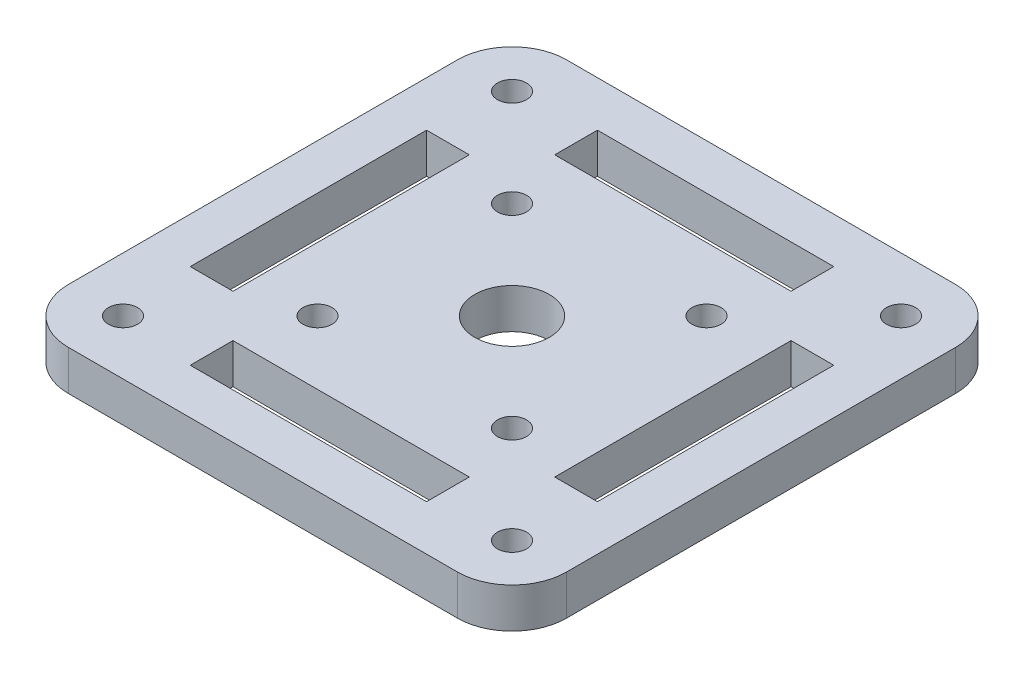
ISO-10303-21;
HEADER;
FILE_DESCRIPTION(('STEP AP214'),'2;1');
FILE_NAME('part.step','',(''),(''),'','','');
FILE_SCHEMA(('AUTOMOTIVE_DESIGN { 1 0 10303 214 1 1 1 1 }'));
ENDSEC;
DATA;
#1=APPLICATION_CONTEXT('core data for automotive mechanical design processes');
#2=APPLICATION_PROTOCOL_DEFINITION('international standard','automotive_design',2000,#1);
#3=PRODUCT_CONTEXT('',#1,'mechanical');
#4=PRODUCT('Part','Part','',(#3));
#5=PRODUCT_RELATED_PRODUCT_CATEGORY('part','',(#4));
#6=PRODUCT_DEFINITION_FORMATION('','',#4);
#7=PRODUCT_DEFINITION_CONTEXT('part definition',#1,'design');
#8=PRODUCT_DEFINITION('design','',#6,#7);
#9=PRODUCT_DEFINITION_SHAPE('','',#8);
#10=(LENGTH_UNIT() NAMED_UNIT(*) SI_UNIT(.MILLI.,.METRE.));
#11=(NAMED_UNIT(*) PLANE_ANGLE_UNIT() SI_UNIT($,.RADIAN.));
#12=(NAMED_UNIT(*) SI_UNIT($,.STERADIAN.) SOLID_ANGLE_UNIT());
#13=UNCERTAINTY_MEASURE_WITH_UNIT(LENGTH_MEASURE(1.E-05),#10,'distance_accuracy_value','');
#14=(GEOMETRIC_REPRESENTATION_CONTEXT(3) GLOBAL_UNCERTAINTY_ASSIGNED_CONTEXT((#13)) GLOBAL_UNIT_ASSIGNED_CONTEXT((#10,
#11,#12)) REPRESENTATION_CONTEXT('',''));
#15=CARTESIAN_POINT('',(0.,0.,0.));
#16=DIRECTION('',(0.,0.,1.));
#17=DIRECTION('',(1.,0.,0.));
#18=AXIS2_PLACEMENT_3D('',#15,#16,#17);
#19=CARTESIAN_POINT('',(0.,4.4,0.));
#20=DIRECTION('',(0.,1.,0.));
#21=DIRECTION('',(0.,0.,1.));
#22=AXIS2_PLACEMENT_3D('',#19,#20,#21);
#23=PLANE('',#22);
#24=CARTESIAN_POINT('',(10.7000000000006,4.4,10.7));
#25=DIRECTION('',(0.,1.,0.));
#26=DIRECTION('',(0.,0.,1.));
#27=AXIS2_PLACEMENT_3D('',#24,#25,#26);
#28=CIRCLE('',#27,1.59999999999985);
#29=CARTESIAN_POINT('',(10.7000000000006,4.4,12.2999999999999));
#30=VERTEX_POINT('',#29);
#31=EDGE_CURVE('E425',#30,#30,#28,.T.);
#32=ORIENTED_EDGE('',*,*,#31,.F.);
#33=EDGE_LOOP('',(#32));
#34=FACE_BOUND('',#33,.T.);
#35=CARTESIAN_POINT('',(-10.6999999999994,4.4,10.7000000000006));
#36=DIRECTION('',(0.,1.,0.));
#37=DIRECTION('',(0.,0.,1.));
#38=AXIS2_PLACEMENT_3D('',#35,#36,#37);
#39=CIRCLE('',#38,1.60000000000044);
#40=CARTESIAN_POINT('',(-10.6999999999994,4.4,12.3000000000011));
#41=VERTEX_POINT('',#40);
#42=EDGE_CURVE('E439',#41,#41,#39,.T.);
#43=ORIENTED_EDGE('',*,*,#42,.F.);
#44=EDGE_LOOP('',(#43));
#45=FACE_BOUND('',#44,.T.);
#46=CARTESIAN_POINT('',(-10.7,4.4,-10.6999999999994));
#47=DIRECTION('',(0.,1.,0.));
#48=DIRECTION('',(0.,0.,1.));
#49=AXIS2_PLACEMENT_3D('',#46,#47,#48);
#50=CIRCLE('',#49,1.60000000000064);
#51=CARTESIAN_POINT('',(-10.7,4.4,-9.09999999999877));
#52=VERTEX_POINT('',#51);
#53=EDGE_CURVE('E436',#52,#52,#50,.T.);
#54=ORIENTED_EDGE('',*,*,#53,.F.);
#55=EDGE_LOOP('',(#54));
#56=FACE_BOUND('',#55,.T.);
#57=CARTESIAN_POINT('',(10.7,4.4,-10.7));
#58=DIRECTION('',(0.,1.,0.));
#59=DIRECTION('',(0.,0.,1.));
#60=AXIS2_PLACEMENT_3D('',#57,#58,#59);
#61=CIRCLE('',#60,1.6);
#62=CARTESIAN_POINT('',(10.7,4.4,-9.10000000000004));
#63=VERTEX_POINT('',#62);
#64=EDGE_CURVE('E421',#63,#63,#61,.T.);
#65=ORIENTED_EDGE('',*,*,#64,.F.);
#66=EDGE_LOOP('',(#65));
#67=FACE_BOUND('',#66,.T.);
#68=CARTESIAN_POINT('',(-21.4,4.4,21.4000000000001));
#69=DIRECTION('',(0.,1.,0.));
#70=DIRECTION('',(0.,0.,1.));
#71=AXIS2_PLACEMENT_3D('',#68,#69,#70);
#72=CIRCLE('',#71,1.6);
#73=CARTESIAN_POINT('',(-21.4,4.4,23.0000000000001));
#74=VERTEX_POINT('',#73);
#75=EDGE_CURVE('E281',#74,#74,#72,.T.);
#76=ORIENTED_EDGE('',*,*,#75,.F.);
#77=EDGE_LOOP('',(#76));
#78=FACE_BOUND('',#77,.T.);
#79=CARTESIAN_POINT('',(21.4,4.4,-21.4000000000001));
#80=DIRECTION('',(0.,1.,0.));
#81=DIRECTION('',(0.,0.,1.));
#82=AXIS2_PLACEMENT_3D('',#79,#80,#81);
#83=CIRCLE('',#82,1.60000000000002);
#84=CARTESIAN_POINT('',(21.4,4.4,-19.8000000000001));
#85=VERTEX_POINT('',#84);
#86=EDGE_CURVE('E324',#85,#85,#83,.T.);
#87=ORIENTED_EDGE('',*,*,#86,.F.);
#88=EDGE_LOOP('',(#87));
#89=FACE_BOUND('',#88,.T.);
#90=DIRECTION('',(0.,0.,1.));
#91=VECTOR('',#90,1.);
#92=CARTESIAN_POINT('',(-27.4,4.4,-27.4000000000001));
#93=LINE('',#92,#91);
#94=CARTESIAN_POINT('',(-27.4,4.4,-21.4000000000001));
#95=VERTEX_POINT('',#94);
#96=CARTESIAN_POINT('',(-27.4,4.4,21.4000000000001));
#97=VERTEX_POINT('',#96);
#98=EDGE_CURVE('E373',#95,#97,#93,.T.);
#99=ORIENTED_EDGE('',*,*,#98,.T.);
#100=CARTESIAN_POINT('',(-21.4,4.4,21.4000000000001));
#101=DIRECTION('',(0.,1.,0.));
#102=DIRECTION('',(0.,0.,1.));
#103=AXIS2_PLACEMENT_3D('',#100,#101,#102);
#104=CIRCLE('',#103,6.);
#105=CARTESIAN_POINT('',(-21.4,4.4,27.4000000000001));
#106=VERTEX_POINT('',#105);
#107=EDGE_CURVE('E411',#97,#106,#104,.T.);
#108=ORIENTED_EDGE('',*,*,#107,.T.);
#109=DIRECTION('',(1.,0.,0.));
#110=VECTOR('',#109,1.);
#111=CARTESIAN_POINT('',(-27.4,4.4,27.4000000000001));
#112=LINE('',#111,#110);
#113=CARTESIAN_POINT('',(21.4,4.4,27.4000000000001));
#114=VERTEX_POINT('',#113);
#115=EDGE_CURVE('E376',#106,#114,#112,.T.);
#116=ORIENTED_EDGE('',*,*,#115,.T.);
#117=CARTESIAN_POINT('',(21.4,4.4,21.4000000000001));
#118=DIRECTION('',(0.,1.,0.));
#119=DIRECTION('',(0.,0.,1.));
#120=AXIS2_PLACEMENT_3D('',#117,#118,#119);
#121=CIRCLE('',#120,6.);
#122=CARTESIAN_POINT('',(27.4,4.4,21.4000000000001));
#123=VERTEX_POINT('',#122);
#124=EDGE_CURVE('E406',#114,#123,#121,.T.);
#125=ORIENTED_EDGE('',*,*,#124,.T.);
#126=DIRECTION('',(0.,0.,-1.));
#127=VECTOR('',#126,1.);
#128=CARTESIAN_POINT('',(27.4,4.4,-27.4000000000001));
#129=LINE('',#128,#127);
#130=CARTESIAN_POINT('',(27.4,4.4,-21.4000000000001));
#131=VERTEX_POINT('',#130);
#132=EDGE_CURVE('E368',#123,#131,#129,.T.);
#133=ORIENTED_EDGE('',*,*,#132,.T.);
#134=CARTESIAN_POINT('',(21.4,4.4,-21.4000000000001));
#135=DIRECTION('',(0.,1.,0.));
#136=DIRECTION('',(0.,0.,1.));
#137=AXIS2_PLACEMENT_3D('',#134,#135,#136);
#138=CIRCLE('',#137,6.);
#139=CARTESIAN_POINT('',(21.4,4.4,-27.4000000000001));
#140=VERTEX_POINT('',#139);
#141=EDGE_CURVE('E59',#131,#140,#138,.T.);
#142=ORIENTED_EDGE('',*,*,#141,.T.);
#143=DIRECTION('',(-1.,0.,0.));
#144=VECTOR('',#143,1.);
#145=CARTESIAN_POINT('',(-27.4,4.4,-27.4000000000001));
#146=LINE('',#145,#144);
#147=CARTESIAN_POINT('',(-21.4,4.4,-27.4000000000001));
#148=VERTEX_POINT('',#147);
#149=EDGE_CURVE('E370',#140,#148,#146,.T.);
#150=ORIENTED_EDGE('',*,*,#149,.T.);
#151=CARTESIAN_POINT('',(-21.4,4.4,-21.4000000000001));
#152=DIRECTION('',(0.,1.,0.));
#153=DIRECTION('',(0.,0.,1.));
#154=AXIS2_PLACEMENT_3D('',#151,#152,#153);
#155=CIRCLE('',#154,6.);
#156=EDGE_CURVE('E409',#148,#95,#155,.T.);
#157=ORIENTED_EDGE('',*,*,#156,.T.);
#158=EDGE_LOOP('',(#99,#108,#116,#125,#133,#142,#150,#157));
#159=FACE_BOUND('',#158,.T.);
#160=CARTESIAN_POINT('',(0.,4.4,0.));
#161=DIRECTION('',(0.,1.,0.));
#162=DIRECTION('',(0.,0.,1.));
#163=AXIS2_PLACEMENT_3D('',#160,#161,#162);
#164=CIRCLE('',#163,4.1);
#165=CARTESIAN_POINT('',(0.,4.4,4.1));
#166=VERTEX_POINT('',#165);
#167=EDGE_CURVE('E362',#166,#166,#164,.T.);
#168=ORIENTED_EDGE('',*,*,#167,.F.);
#169=EDGE_LOOP('',(#168));
#170=FACE_BOUND('',#169,.T.);
#171=DIRECTION('',(0.,0.,-1.));
#172=VECTOR('',#171,1.);
#173=CARTESIAN_POINT('',(22.4,4.4,13.));
#174=LINE('',#173,#172);
#175=CARTESIAN_POINT('',(22.4,4.4,13.));
#176=VERTEX_POINT('',#175);
#177=CARTESIAN_POINT('',(22.4,4.4,-13.));
#178=VERTEX_POINT('',#177);
#179=EDGE_CURVE('E332',#176,#178,#174,.T.);
#180=ORIENTED_EDGE('',*,*,#179,.F.);
#181=DIRECTION('',(1.,0.,0.));
#182=VECTOR('',#181,1.);
#183=CARTESIAN_POINT('',(17.7,4.4,13.));
#184=LINE('',#183,#182);
#185=CARTESIAN_POINT('',(17.7,4.4,13.));
#186=VERTEX_POINT('',#185);
#187=EDGE_CURVE('E330',#186,#176,#184,.T.);
#188=ORIENTED_EDGE('',*,*,#187,.F.);
#189=DIRECTION('',(0.,0.,1.));
#190=VECTOR('',#189,1.);
#191=CARTESIAN_POINT('',(17.7,4.4,-5.));
#192=LINE('',#191,#190);
#193=CARTESIAN_POINT('',(17.7,4.4,-13.));
#194=VERTEX_POINT('',#193);
#195=EDGE_CURVE('E338',#194,#186,#192,.T.);
#196=ORIENTED_EDGE('',*,*,#195,.F.);
#197=DIRECTION('',(-1.,0.,0.));
#198=VECTOR('',#197,1.);
#199=CARTESIAN_POINT('',(17.7,4.4,-13.));
#200=LINE('',#199,#198);
#201=EDGE_CURVE('E335',#178,#194,#200,.T.);
#202=ORIENTED_EDGE('',*,*,#201,.F.);
#203=EDGE_LOOP('',(#180,#188,#196,#202));
#204=FACE_BOUND('',#203,.T.);
#205=CARTESIAN_POINT('',(21.4,4.4,21.4000000000001));
#206=DIRECTION('',(0.,1.,0.));
#207=DIRECTION('',(0.,0.,-1.));
#208=AXIS2_PLACEMENT_3D('',#205,#206,#207);
#209=CIRCLE('',#208,1.6);
#210=CARTESIAN_POINT('',(21.4,4.4,19.8000000000001));
#211=VERTEX_POINT('',#210);
#212=EDGE_CURVE('E318',#211,#211,#209,.T.);
#213=ORIENTED_EDGE('',*,*,#212,.F.);
#214=EDGE_LOOP('',(#213));
#215=FACE_BOUND('',#214,.T.);
#216=DIRECTION('',(-1.,0.,0.));
#217=VECTOR('',#216,1.);
#218=CARTESIAN_POINT('',(12.9999999999999,4.4,-22.4));
#219=LINE('',#218,#217);
#220=CARTESIAN_POINT('',(12.9999999999999,4.4,-22.4));
#221=VERTEX_POINT('',#220);
#222=CARTESIAN_POINT('',(-13.0000000000001,4.4,-22.3999999999999));
#223=VERTEX_POINT('',#222);
#224=EDGE_CURVE('E292',#221,#223,#219,.T.);
#225=ORIENTED_EDGE('',*,*,#224,.F.);
#226=DIRECTION('',(0.,0.,-1.));
#227=VECTOR('',#226,1.);
#228=CARTESIAN_POINT('',(12.9999999999999,4.4,-17.7));
#229=LINE('',#228,#227);
#230=CARTESIAN_POINT('',(12.9999999999999,4.4,-17.7));
#231=VERTEX_POINT('',#230);
#232=EDGE_CURVE('E289',#231,#221,#229,.T.);
#233=ORIENTED_EDGE('',*,*,#232,.F.);
#234=DIRECTION('',(1.,0.,0.));
#235=VECTOR('',#234,1.);
#236=CARTESIAN_POINT('',(-5.00000000000006,4.4,-17.7));
#237=LINE('',#236,#235);
#238=CARTESIAN_POINT('',(-13.0000000000001,4.4,-17.6999999999999));
#239=VERTEX_POINT('',#238);
#240=EDGE_CURVE('E287',#239,#231,#237,.T.);
#241=ORIENTED_EDGE('',*,*,#240,.F.);
#242=DIRECTION('',(0.,0.,1.));
#243=VECTOR('',#242,1.);
#244=CARTESIAN_POINT('',(-13.0000000000001,4.4,-17.6999999999999));
#245=LINE('',#244,#243);
#246=EDGE_CURVE('E294',#223,#239,#245,.T.);
#247=ORIENTED_EDGE('',*,*,#246,.F.);
#248=EDGE_LOOP('',(#225,#233,#241,#247));
#249=FACE_BOUND('',#248,.T.);
#250=CARTESIAN_POINT('',(-21.4,4.4,-21.4000000000001));
#251=DIRECTION('',(0.,1.,0.));
#252=DIRECTION('',(0.,0.,-1.));
#253=AXIS2_PLACEMENT_3D('',#250,#251,#252);
#254=CIRCLE('',#253,1.6);
#255=CARTESIAN_POINT('',(-21.4,4.4,-23.0000000000001));
#256=VERTEX_POINT('',#255);
#257=EDGE_CURVE('E275',#256,#256,#254,.T.);
#258=ORIENTED_EDGE('',*,*,#257,.F.);
#259=EDGE_LOOP('',(#258));
#260=FACE_BOUND('',#259,.T.);
#261=DIRECTION('',(1.,0.,0.));
#262=VECTOR('',#261,1.);
#263=CARTESIAN_POINT('',(-13.0000000000001,4.4,22.3999999999999));
#264=LINE('',#263,#262);
#265=CARTESIAN_POINT('',(-13.0000000000001,4.4,22.3999999999999));
#266=VERTEX_POINT('',#265);
#267=CARTESIAN_POINT('',(12.9999999999999,4.4,22.4));
#268=VERTEX_POINT('',#267);
#269=EDGE_CURVE('E249',#266,#268,#264,.T.);
#270=ORIENTED_EDGE('',*,*,#269,.F.);
#271=DIRECTION('',(0.,0.,1.));
#272=VECTOR('',#271,1.);
#273=CARTESIAN_POINT('',(-13.0000000000001,4.4,17.6999999999999));
#274=LINE('',#273,#272);
#275=CARTESIAN_POINT('',(-13.0000000000001,4.4,17.6999999999999));
#276=VERTEX_POINT('',#275);
#277=EDGE_CURVE('E246',#276,#266,#274,.T.);
#278=ORIENTED_EDGE('',*,*,#277,.F.);
#279=DIRECTION('',(-1.,0.,0.));
#280=VECTOR('',#279,1.);
#281=CARTESIAN_POINT('',(4.99999999999994,4.4,17.7));
#282=LINE('',#281,#280);
#283=CARTESIAN_POINT('',(12.9999999999999,4.4,17.7));
#284=VERTEX_POINT('',#283);
#285=EDGE_CURVE('E244',#284,#276,#282,.T.);
#286=ORIENTED_EDGE('',*,*,#285,.F.);
#287=DIRECTION('',(0.,0.,-1.));
#288=VECTOR('',#287,1.);
#289=CARTESIAN_POINT('',(12.9999999999999,4.4,17.7));
#290=LINE('',#289,#288);
#291=EDGE_CURVE('E251',#268,#284,#290,.T.);
#292=ORIENTED_EDGE('',*,*,#291,.F.);
#293=EDGE_LOOP('',(#270,#278,#286,#292));
#294=FACE_BOUND('',#293,.T.);
#295=DIRECTION('',(-1.,0.,0.));
#296=VECTOR('',#295,1.);
#297=CARTESIAN_POINT('',(-17.6999999999999,4.4,-13.0000000000001));
#298=LINE('',#297,#296);
#299=CARTESIAN_POINT('',(-17.6999999999999,4.4,-13.0000000000001));
#300=VERTEX_POINT('',#299);
#301=CARTESIAN_POINT('',(-22.3999999999999,4.4,-13.0000000000002));
#302=VERTEX_POINT('',#301);
#303=EDGE_CURVE('E209',#300,#302,#298,.T.);
#304=ORIENTED_EDGE('',*,*,#303,.F.);
#305=DIRECTION('',(0.,0.,-1.));
#306=VECTOR('',#305,1.);
#307=CARTESIAN_POINT('',(-17.7,4.4,4.99999999999986));
#308=LINE('',#307,#306);
#309=CARTESIAN_POINT('',(-17.7000000000001,4.4,12.9999999999999));
#310=VERTEX_POINT('',#309);
#311=EDGE_CURVE('E199',#310,#300,#308,.T.);
#312=ORIENTED_EDGE('',*,*,#311,.F.);
#313=DIRECTION('',(1.,0.,0.));
#314=VECTOR('',#313,1.);
#315=CARTESIAN_POINT('',(-17.7000000000001,4.4,12.9999999999999));
#316=LINE('',#315,#314);
#317=CARTESIAN_POINT('',(-22.4000000000001,4.4,12.9999999999998));
#318=VERTEX_POINT('',#317);
#319=EDGE_CURVE('E226',#318,#310,#316,.T.);
#320=ORIENTED_EDGE('',*,*,#319,.F.);
#321=DIRECTION('',(0.,0.,1.));
#322=VECTOR('',#321,1.);
#323=CARTESIAN_POINT('',(-22.3999999999999,4.4,-13.0000000000002));
#324=LINE('',#323,#322);
#325=EDGE_CURVE('E224',#302,#318,#324,.T.);
#326=ORIENTED_EDGE('',*,*,#325,.F.);
#327=EDGE_LOOP('',(#304,#312,#320,#326));
#328=FACE_BOUND('',#327,.T.);
#329=ADVANCED_FACE('F35',(#34,#45,#56,#67,#78,#89,#159,#170,#204,#215,#249,#260,#294,#328),#23,.T.);
#330=CARTESIAN_POINT('',(0.,0.,0.));
#331=DIRECTION('',(0.,1.,0.));
#332=DIRECTION('',(0.,0.,1.));
#333=AXIS2_PLACEMENT_3D('',#330,#331,#332);
#334=PLANE('',#333);
#335=CARTESIAN_POINT('',(10.7000000000006,0.,10.7));
#336=DIRECTION('',(0.,1.,0.));
#337=DIRECTION('',(0.,0.,1.));
#338=AXIS2_PLACEMENT_3D('',#335,#336,#337);
#339=CIRCLE('',#338,1.59999999999985);
#340=CARTESIAN_POINT('',(10.7000000000006,0.,12.2999999999999));
#341=VERTEX_POINT('',#340);
#342=EDGE_CURVE('E39',#341,#341,#339,.T.);
#343=ORIENTED_EDGE('',*,*,#342,.T.);
#344=EDGE_LOOP('',(#343));
#345=FACE_BOUND('',#344,.T.);
#346=CARTESIAN_POINT('',(-10.6999999999994,0.,10.7000000000006));
#347=DIRECTION('',(0.,1.,0.));
#348=DIRECTION('',(0.,0.,1.));
#349=AXIS2_PLACEMENT_3D('',#346,#347,#348);
#350=CIRCLE('',#349,1.60000000000044);
#351=CARTESIAN_POINT('',(-10.6999999999994,0.,12.3000000000011));
#352=VERTEX_POINT('',#351);
#353=EDGE_CURVE('E424',#352,#352,#350,.T.);
#354=ORIENTED_EDGE('',*,*,#353,.T.);
#355=EDGE_LOOP('',(#354));
#356=FACE_BOUND('',#355,.T.);
#357=CARTESIAN_POINT('',(-10.7,0.,-10.6999999999994));
#358=DIRECTION('',(0.,1.,0.));
#359=DIRECTION('',(0.,0.,1.));
#360=AXIS2_PLACEMENT_3D('',#357,#358,#359);
#361=CIRCLE('',#360,1.60000000000064);
#362=CARTESIAN_POINT('',(-10.7,0.,-9.09999999999877));
#363=VERTEX_POINT('',#362);
#364=EDGE_CURVE('E422',#363,#363,#361,.T.);
#365=ORIENTED_EDGE('',*,*,#364,.T.);
#366=EDGE_LOOP('',(#365));
#367=FACE_BOUND('',#366,.T.);
#368=CARTESIAN_POINT('',(10.7,0.,-10.7));
#369=DIRECTION('',(0.,1.,0.));
#370=DIRECTION('',(0.,0.,1.));
#371=AXIS2_PLACEMENT_3D('',#368,#369,#370);
#372=CIRCLE('',#371,1.6);
#373=CARTESIAN_POINT('',(10.7,0.,-9.10000000000004));
#374=VERTEX_POINT('',#373);
#375=EDGE_CURVE('E233',#374,#374,#372,.T.);
#376=ORIENTED_EDGE('',*,*,#375,.T.);
#377=EDGE_LOOP('',(#376));
#378=FACE_BOUND('',#377,.T.);
#379=DIRECTION('',(0.,0.,1.));
#380=VECTOR('',#379,1.);
#381=CARTESIAN_POINT('',(-13.0000000000001,0.,17.6999999999999));
#382=LINE('',#381,#380);
#383=CARTESIAN_POINT('',(-13.0000000000001,0.,17.6999999999999));
#384=VERTEX_POINT('',#383);
#385=CARTESIAN_POINT('',(-13.0000000000001,0.,22.3999999999999));
#386=VERTEX_POINT('',#385);
#387=EDGE_CURVE('E219',#384,#386,#382,.T.);
#388=ORIENTED_EDGE('',*,*,#387,.T.);
#389=DIRECTION('',(1.,0.,0.));
#390=VECTOR('',#389,1.);
#391=CARTESIAN_POINT('',(12.9999999999999,0.,22.4));
#392=LINE('',#391,#390);
#393=CARTESIAN_POINT('',(12.9999999999999,0.,22.4));
#394=VERTEX_POINT('',#393);
#395=EDGE_CURVE('E257',#386,#394,#392,.T.);
#396=ORIENTED_EDGE('',*,*,#395,.T.);
#397=DIRECTION('',(0.,0.,-1.));
#398=VECTOR('',#397,1.);
#399=CARTESIAN_POINT('',(12.9999999999999,0.,17.7));
#400=LINE('',#399,#398);
#401=CARTESIAN_POINT('',(12.9999999999999,0.,17.7));
#402=VERTEX_POINT('',#401);
#403=EDGE_CURVE('E260',#394,#402,#400,.T.);
#404=ORIENTED_EDGE('',*,*,#403,.T.);
#405=DIRECTION('',(-1.,0.,0.));
#406=VECTOR('',#405,1.);
#407=CARTESIAN_POINT('',(4.99999999999994,0.,17.7));
#408=LINE('',#407,#406);
#409=EDGE_CURVE('E247',#402,#384,#408,.T.);
#410=ORIENTED_EDGE('',*,*,#409,.T.);
#411=EDGE_LOOP('',(#388,#396,#404,#410));
#412=FACE_BOUND('',#411,.T.);
#413=CARTESIAN_POINT('',(21.4,0.,21.4000000000001));
#414=DIRECTION('',(0.,1.,0.));
#415=DIRECTION('',(0.,0.,-1.));
#416=AXIS2_PLACEMENT_3D('',#413,#414,#415);
#417=CIRCLE('',#416,1.6);
#418=CARTESIAN_POINT('',(21.4,0.,19.8000000000001));
#419=VERTEX_POINT('',#418);
#420=EDGE_CURVE('E317',#419,#419,#417,.T.);
#421=ORIENTED_EDGE('',*,*,#420,.T.);
#422=EDGE_LOOP('',(#421));
#423=FACE_BOUND('',#422,.T.);
#424=CARTESIAN_POINT('',(21.4,0.,-21.4000000000001));
#425=DIRECTION('',(0.,1.,0.));
#426=DIRECTION('',(0.,0.,1.));
#427=AXIS2_PLACEMENT_3D('',#424,#425,#426);
#428=CIRCLE('',#427,1.60000000000002);
#429=CARTESIAN_POINT('',(21.4,0.,-19.8000000000001));
#430=VERTEX_POINT('',#429);
#431=EDGE_CURVE('E321',#430,#430,#428,.T.);
#432=ORIENTED_EDGE('',*,*,#431,.T.);
#433=EDGE_LOOP('',(#432));
#434=FACE_BOUND('',#433,.T.);
#435=DIRECTION('',(1.,0.,0.));
#436=VECTOR('',#435,1.);
#437=CARTESIAN_POINT('',(17.7,0.,13.));
#438=LINE('',#437,#436);
#439=CARTESIAN_POINT('',(17.7,0.,13.));
#440=VERTEX_POINT('',#439);
#441=CARTESIAN_POINT('',(22.4,0.,13.));
#442=VERTEX_POINT('',#441);
#443=EDGE_CURVE('E327',#440,#442,#438,.T.);
#444=ORIENTED_EDGE('',*,*,#443,.T.);
#445=DIRECTION('',(0.,0.,-1.));
#446=VECTOR('',#445,1.);
#447=CARTESIAN_POINT('',(22.4,0.,-13.));
#448=LINE('',#447,#446);
#449=CARTESIAN_POINT('',(22.4,0.,-13.));
#450=VERTEX_POINT('',#449);
#451=EDGE_CURVE('E343',#442,#450,#448,.T.);
#452=ORIENTED_EDGE('',*,*,#451,.T.);
#453=DIRECTION('',(-1.,0.,0.));
#454=VECTOR('',#453,1.);
#455=CARTESIAN_POINT('',(17.7,0.,-13.));
#456=LINE('',#455,#454);
#457=CARTESIAN_POINT('',(17.7,0.,-13.));
#458=VERTEX_POINT('',#457);
#459=EDGE_CURVE('E346',#450,#458,#456,.T.);
#460=ORIENTED_EDGE('',*,*,#459,.T.);
#461=DIRECTION('',(0.,0.,1.));
#462=VECTOR('',#461,1.);
#463=CARTESIAN_POINT('',(17.7,0.,5.));
#464=LINE('',#463,#462);
#465=EDGE_CURVE('E333',#458,#440,#464,.T.);
#466=ORIENTED_EDGE('',*,*,#465,.T.);
#467=EDGE_LOOP('',(#444,#452,#460,#466));
#468=FACE_BOUND('',#467,.T.);
#469=DIRECTION('',(1.,0.,0.));
#470=VECTOR('',#469,1.);
#471=CARTESIAN_POINT('',(-27.4,0.,27.4000000000001));
#472=LINE('',#471,#470);
#473=CARTESIAN_POINT('',(-21.4,0.,27.4000000000001));
#474=VERTEX_POINT('',#473);
#475=CARTESIAN_POINT('',(21.4,0.,27.4000000000001));
#476=VERTEX_POINT('',#475);
#477=EDGE_CURVE('E371',#474,#476,#472,.T.);
#478=ORIENTED_EDGE('',*,*,#477,.F.);
#479=CARTESIAN_POINT('',(-21.4,0.,21.4000000000001));
#480=DIRECTION('',(0.,1.,0.));
#481=DIRECTION('',(0.,0.,1.));
#482=AXIS2_PLACEMENT_3D('',#479,#480,#481);
#483=CIRCLE('',#482,6.);
#484=CARTESIAN_POINT('',(-27.4,0.,21.4000000000001));
#485=VERTEX_POINT('',#484);
#486=EDGE_CURVE('E399',#474,#485,#483,.F.);
#487=ORIENTED_EDGE('',*,*,#486,.T.);
#488=DIRECTION('',(0.,0.,1.));
#489=VECTOR('',#488,1.);
#490=CARTESIAN_POINT('',(-27.4,0.,-27.4000000000001));
#491=LINE('',#490,#489);
#492=CARTESIAN_POINT('',(-27.4,0.,-21.4000000000001));
#493=VERTEX_POINT('',#492);
#494=EDGE_CURVE('E384',#493,#485,#491,.T.);
#495=ORIENTED_EDGE('',*,*,#494,.F.);
#496=CARTESIAN_POINT('',(-21.4,0.,-21.4000000000001));
#497=DIRECTION('',(0.,1.,0.));
#498=DIRECTION('',(0.,0.,1.));
#499=AXIS2_PLACEMENT_3D('',#496,#497,#498);
#500=CIRCLE('',#499,6.);
#501=CARTESIAN_POINT('',(-21.4,0.,-27.4000000000001));
#502=VERTEX_POINT('',#501);
#503=EDGE_CURVE('E397',#493,#502,#500,.F.);
#504=ORIENTED_EDGE('',*,*,#503,.T.);
#505=DIRECTION('',(-1.,0.,0.));
#506=VECTOR('',#505,1.);
#507=CARTESIAN_POINT('',(-27.4,0.,-27.4000000000001));
#508=LINE('',#507,#506);
#509=CARTESIAN_POINT('',(21.4,0.,-27.4000000000001));
#510=VERTEX_POINT('',#509);
#511=EDGE_CURVE('E382',#510,#502,#508,.T.);
#512=ORIENTED_EDGE('',*,*,#511,.F.);
#513=CARTESIAN_POINT('',(21.4,0.,-21.4000000000001));
#514=DIRECTION('',(0.,1.,0.));
#515=DIRECTION('',(0.,0.,1.));
#516=AXIS2_PLACEMENT_3D('',#513,#514,#515);
#517=CIRCLE('',#516,6.);
#518=CARTESIAN_POINT('',(27.4,0.,-21.4000000000001));
#519=VERTEX_POINT('',#518);
#520=EDGE_CURVE('E395',#510,#519,#517,.F.);
#521=ORIENTED_EDGE('',*,*,#520,.T.);
#522=DIRECTION('',(0.,0.,-1.));
#523=VECTOR('',#522,1.);
#524=CARTESIAN_POINT('',(27.4,0.,-27.4000000000001));
#525=LINE('',#524,#523);
#526=CARTESIAN_POINT('',(27.4,0.,21.4000000000001));
#527=VERTEX_POINT('',#526);
#528=EDGE_CURVE('E365',#527,#519,#525,.T.);
#529=ORIENTED_EDGE('',*,*,#528,.F.);
#530=CARTESIAN_POINT('',(21.4,0.,21.4000000000001));
#531=DIRECTION('',(0.,1.,0.));
#532=DIRECTION('',(0.,0.,1.));
#533=AXIS2_PLACEMENT_3D('',#530,#531,#532);
#534=CIRCLE('',#533,6.);
#535=EDGE_CURVE('E393',#527,#476,#534,.F.);
#536=ORIENTED_EDGE('',*,*,#535,.T.);
#537=EDGE_LOOP('',(#478,#487,#495,#504,#512,#521,#529,#536));
#538=FACE_BOUND('',#537,.T.);
#539=CARTESIAN_POINT('',(0.,0.,0.));
#540=DIRECTION('',(0.,1.,0.));
#541=DIRECTION('',(0.,0.,1.));
#542=AXIS2_PLACEMENT_3D('',#539,#540,#541);
#543=CIRCLE('',#542,4.1);
#544=CARTESIAN_POINT('',(0.,0.,4.1));
#545=VERTEX_POINT('',#544);
#546=EDGE_CURVE('E361',#545,#545,#543,.T.);
#547=ORIENTED_EDGE('',*,*,#546,.T.);
#548=EDGE_LOOP('',(#547));
#549=FACE_BOUND('',#548,.T.);
#550=DIRECTION('',(0.,0.,-1.));
#551=VECTOR('',#550,1.);
#552=CARTESIAN_POINT('',(12.9999999999999,0.,-17.7));
#553=LINE('',#552,#551);
#554=CARTESIAN_POINT('',(12.9999999999999,0.,-17.7));
#555=VERTEX_POINT('',#554);
#556=CARTESIAN_POINT('',(12.9999999999999,0.,-22.4));
#557=VERTEX_POINT('',#556);
#558=EDGE_CURVE('E284',#555,#557,#553,.T.);
#559=ORIENTED_EDGE('',*,*,#558,.T.);
#560=DIRECTION('',(-1.,0.,0.));
#561=VECTOR('',#560,1.);
#562=CARTESIAN_POINT('',(-13.0000000000001,0.,-22.3999999999999));
#563=LINE('',#562,#561);
#564=CARTESIAN_POINT('',(-13.0000000000001,0.,-22.3999999999999));
#565=VERTEX_POINT('',#564);
#566=EDGE_CURVE('E300',#557,#565,#563,.T.);
#567=ORIENTED_EDGE('',*,*,#566,.T.);
#568=DIRECTION('',(0.,0.,1.));
#569=VECTOR('',#568,1.);
#570=CARTESIAN_POINT('',(-13.0000000000001,0.,-17.6999999999999));
#571=LINE('',#570,#569);
#572=CARTESIAN_POINT('',(-13.0000000000001,0.,-17.6999999999999));
#573=VERTEX_POINT('',#572);
#574=EDGE_CURVE('E303',#565,#573,#571,.T.);
#575=ORIENTED_EDGE('',*,*,#574,.T.);
#576=DIRECTION('',(1.,0.,0.));
#577=VECTOR('',#576,1.);
#578=CARTESIAN_POINT('',(-5.00000000000006,0.,-17.7));
#579=LINE('',#578,#577);
#580=EDGE_CURVE('E290',#573,#555,#579,.T.);
#581=ORIENTED_EDGE('',*,*,#580,.T.);
#582=EDGE_LOOP('',(#559,#567,#575,#581));
#583=FACE_BOUND('',#582,.T.);
#584=CARTESIAN_POINT('',(-21.4,0.,21.4000000000001));
#585=DIRECTION('',(0.,1.,0.));
#586=DIRECTION('',(0.,0.,1.));
#587=AXIS2_PLACEMENT_3D('',#584,#585,#586);
#588=CIRCLE('',#587,1.6);
#589=CARTESIAN_POINT('',(-21.4,0.,23.0000000000001));
#590=VERTEX_POINT('',#589);
#591=EDGE_CURVE('E278',#590,#590,#588,.T.);
#592=ORIENTED_EDGE('',*,*,#591,.T.);
#593=EDGE_LOOP('',(#592));
#594=FACE_BOUND('',#593,.T.);
#595=CARTESIAN_POINT('',(-21.4,0.,-21.4000000000001));
#596=DIRECTION('',(0.,1.,0.));
#597=DIRECTION('',(0.,0.,-1.));
#598=AXIS2_PLACEMENT_3D('',#595,#596,#597);
#599=CIRCLE('',#598,1.6);
#600=CARTESIAN_POINT('',(-21.4,0.,-23.0000000000001));
#601=VERTEX_POINT('',#600);
#602=EDGE_CURVE('E274',#601,#601,#599,.T.);
#603=ORIENTED_EDGE('',*,*,#602,.T.);
#604=EDGE_LOOP('',(#603));
#605=FACE_BOUND('',#604,.T.);
#606=DIRECTION('',(0.,0.,-1.));
#607=VECTOR('',#606,1.);
#608=CARTESIAN_POINT('',(-17.6999999999999,0.,-5.00000000000013));
#609=LINE('',#608,#607);
#610=CARTESIAN_POINT('',(-17.7000000000001,0.,12.9999999999999));
#611=VERTEX_POINT('',#610);
#612=CARTESIAN_POINT('',(-17.6999999999999,0.,-13.0000000000001));
#613=VERTEX_POINT('',#612);
#614=EDGE_CURVE('E231',#611,#613,#609,.T.);
#615=ORIENTED_EDGE('',*,*,#614,.T.);
#616=DIRECTION('',(-1.,0.,0.));
#617=VECTOR('',#616,1.);
#618=CARTESIAN_POINT('',(-17.6999999999999,0.,-13.0000000000001));
#619=LINE('',#618,#617);
#620=CARTESIAN_POINT('',(-22.3999999999999,0.,-13.0000000000002));
#621=VERTEX_POINT('',#620);
#622=EDGE_CURVE('E217',#613,#621,#619,.T.);
#623=ORIENTED_EDGE('',*,*,#622,.T.);
#624=DIRECTION('',(0.,0.,1.));
#625=VECTOR('',#624,1.);
#626=CARTESIAN_POINT('',(-22.4000000000001,0.,12.9999999999998));
#627=LINE('',#626,#625);
#628=CARTESIAN_POINT('',(-22.4000000000001,0.,12.9999999999998));
#629=VERTEX_POINT('',#628);
#630=EDGE_CURVE('E235',#621,#629,#627,.T.);
#631=ORIENTED_EDGE('',*,*,#630,.T.);
#632=DIRECTION('',(1.,0.,0.));
#633=VECTOR('',#632,1.);
#634=CARTESIAN_POINT('',(-17.7000000000001,0.,12.9999999999999));
#635=LINE('',#634,#633);
#636=EDGE_CURVE('E210',#629,#611,#635,.T.);
#637=ORIENTED_EDGE('',*,*,#636,.T.);
#638=EDGE_LOOP('',(#615,#623,#631,#637));
#639=FACE_BOUND('',#638,.T.);
#640=ADVANCED_FACE('F450',(#345,#356,#367,#378,#412,#423,#434,#468,#538,#549,#583,#594,#605,
#639),#334,.F.);
#641=CARTESIAN_POINT('',(27.4,4.4,-27.4000000000001));
#642=DIRECTION('',(-1.,0.,0.));
#643=DIRECTION('',(0.,0.,1.));
#644=AXIS2_PLACEMENT_3D('',#641,#642,#643);
#645=PLANE('',#644);
#646=ORIENTED_EDGE('',*,*,#528,.T.);
#647=DIRECTION('',(0.,-1.,0.));
#648=VECTOR('',#647,1.);
#649=CARTESIAN_POINT('',(27.4,4.4,-21.4000000000001));
#650=LINE('',#649,#648);
#651=EDGE_CURVE('E11',#519,#131,#650,.F.);
#652=ORIENTED_EDGE('',*,*,#651,.T.);
#653=ORIENTED_EDGE('',*,*,#132,.F.);
#654=DIRECTION('',(0.,-1.,0.));
#655=VECTOR('',#654,1.);
#656=CARTESIAN_POINT('',(27.4,4.4,21.4000000000001));
#657=LINE('',#656,#655);
#658=EDGE_CURVE('E44',#123,#527,#657,.T.);
#659=ORIENTED_EDGE('',*,*,#658,.T.);
#660=EDGE_LOOP('',(#646,#652,#653,#659));
#661=FACE_BOUND('',#660,.T.);
#662=ADVANCED_FACE('F565',(#661),#645,.F.);
#663=CARTESIAN_POINT('',(-27.4,4.4,-27.4000000000001));
#664=DIRECTION('',(0.,0.,1.));
#665=DIRECTION('',(1.,0.,0.));
#666=AXIS2_PLACEMENT_3D('',#663,#664,#665);
#667=PLANE('',#666);
#668=ORIENTED_EDGE('',*,*,#511,.T.);
#669=DIRECTION('',(0.,-1.,0.));
#670=VECTOR('',#669,1.);
#671=CARTESIAN_POINT('',(-21.4,4.4,-27.4000000000001));
#672=LINE('',#671,#670);
#673=EDGE_CURVE('E52',#502,#148,#672,.F.);
#674=ORIENTED_EDGE('',*,*,#673,.T.);
#675=ORIENTED_EDGE('',*,*,#149,.F.);
#676=DIRECTION('',(0.,-1.,0.));
#677=VECTOR('',#676,1.);
#678=CARTESIAN_POINT('',(21.4,4.4,-27.4000000000001));
#679=LINE('',#678,#677);
#680=EDGE_CURVE('E413',#140,#510,#679,.T.);
#681=ORIENTED_EDGE('',*,*,#680,.T.);
#682=EDGE_LOOP('',(#668,#674,#675,#681));
#683=FACE_BOUND('',#682,.T.);
#684=ADVANCED_FACE('F572',(#683),#667,.F.);
#685=CARTESIAN_POINT('',(-27.4,4.4,-27.4000000000001));
#686=DIRECTION('',(1.,0.,0.));
#687=DIRECTION('',(0.,0.,-1.));
#688=AXIS2_PLACEMENT_3D('',#685,#686,#687);
#689=PLANE('',#688);
#690=ORIENTED_EDGE('',*,*,#494,.T.);
#691=DIRECTION('',(0.,-1.,0.));
#692=VECTOR('',#691,1.);
#693=CARTESIAN_POINT('',(-27.4,4.4,21.4000000000001));
#694=LINE('',#693,#692);
#695=EDGE_CURVE('E404',#485,#97,#694,.F.);
#696=ORIENTED_EDGE('',*,*,#695,.T.);
#697=ORIENTED_EDGE('',*,*,#98,.F.);
#698=DIRECTION('',(0.,-1.,0.));
#699=VECTOR('',#698,1.);
#700=CARTESIAN_POINT('',(-27.4,4.4,-21.4000000000001));
#701=LINE('',#700,#699);
#702=EDGE_CURVE('E401',#95,#493,#701,.T.);
#703=ORIENTED_EDGE('',*,*,#702,.T.);
#704=EDGE_LOOP('',(#690,#696,#697,#703));
#705=FACE_BOUND('',#704,.T.);
#706=ADVANCED_FACE('F568',(#705),#689,.F.);
#707=CARTESIAN_POINT('',(-27.4,4.4,27.4000000000001));
#708=DIRECTION('',(0.,0.,-1.));
#709=DIRECTION('',(-1.,0.,0.));
#710=AXIS2_PLACEMENT_3D('',#707,#708,#709);
#711=PLANE('',#710);
#712=ORIENTED_EDGE('',*,*,#115,.F.);
#713=DIRECTION('',(0.,-1.,0.));
#714=VECTOR('',#713,1.);
#715=CARTESIAN_POINT('',(-21.4,4.4,27.4000000000001));
#716=LINE('',#715,#714);
#717=EDGE_CURVE('E390',#106,#474,#716,.T.);
#718=ORIENTED_EDGE('',*,*,#717,.T.);
#719=ORIENTED_EDGE('',*,*,#477,.T.);
#720=DIRECTION('',(0.,-1.,0.));
#721=VECTOR('',#720,1.);
#722=CARTESIAN_POINT('',(21.4,4.4,27.4000000000001));
#723=LINE('',#722,#721);
#724=EDGE_CURVE('E379',#476,#114,#723,.F.);
#725=ORIENTED_EDGE('',*,*,#724,.T.);
#726=EDGE_LOOP('',(#712,#718,#719,#725));
#727=FACE_BOUND('',#726,.T.);
#728=ADVANCED_FACE('F560',(#727),#711,.F.);
#729=CARTESIAN_POINT('',(0.,4.4,0.));
#730=DIRECTION('',(0.,-1.,0.));
#731=DIRECTION('',(0.,0.,-1.));
#732=AXIS2_PLACEMENT_3D('',#729,#730,#731);
#733=CYLINDRICAL_SURFACE('',#732,4.1);
#734=ORIENTED_EDGE('',*,*,#167,.T.);
#735=EDGE_LOOP('',(#734));
#736=FACE_BOUND('',#735,.T.);
#737=ORIENTED_EDGE('',*,*,#546,.F.);
#738=EDGE_LOOP('',(#737));
#739=FACE_BOUND('',#738,.T.);
#740=ADVANCED_FACE('F557',(#736,#739),#733,.F.);
#741=CARTESIAN_POINT('',(17.7,4.4,13.));
#742=DIRECTION('',(0.,0.,-1.));
#743=DIRECTION('',(-1.,0.,0.));
#744=AXIS2_PLACEMENT_3D('',#741,#742,#743);
#745=PLANE('',#744);
#746=ORIENTED_EDGE('',*,*,#443,.F.);
#747=DIRECTION('',(0.,-1.,0.));
#748=VECTOR('',#747,1.);
#749=CARTESIAN_POINT('',(17.7,4.4,13.));
#750=LINE('',#749,#748);
#751=EDGE_CURVE('E340',#186,#440,#750,.T.);
#752=ORIENTED_EDGE('',*,*,#751,.F.);
#753=ORIENTED_EDGE('',*,*,#187,.T.);
#754=DIRECTION('',(0.,-1.,0.));
#755=VECTOR('',#754,1.);
#756=CARTESIAN_POINT('',(22.4,4.4,13.));
#757=LINE('',#756,#755);
#758=EDGE_CURVE('E358',#176,#442,#757,.T.);
#759=ORIENTED_EDGE('',*,*,#758,.T.);
#760=EDGE_LOOP('',(#746,#752,#753,#759));
#761=FACE_BOUND('',#760,.T.);
#762=ADVANCED_FACE('F553',(#761),#745,.T.);
#763=CARTESIAN_POINT('',(22.4,4.4,-13.));
#764=DIRECTION('',(-1.,0.,0.));
#765=DIRECTION('',(0.,0.,1.));
#766=AXIS2_PLACEMENT_3D('',#763,#764,#765);
#767=PLANE('',#766);
#768=ORIENTED_EDGE('',*,*,#451,.F.);
#769=ORIENTED_EDGE('',*,*,#758,.F.);
#770=ORIENTED_EDGE('',*,*,#179,.T.);
#771=DIRECTION('',(0.,-1.,0.));
#772=VECTOR('',#771,1.);
#773=CARTESIAN_POINT('',(22.4,4.4,-13.));
#774=LINE('',#773,#772);
#775=EDGE_CURVE('E356',#178,#450,#774,.T.);
#776=ORIENTED_EDGE('',*,*,#775,.T.);
#777=EDGE_LOOP('',(#768,#769,#770,#776));
#778=FACE_BOUND('',#777,.T.);
#779=ADVANCED_FACE('F549',(#778),#767,.T.);
#780=CARTESIAN_POINT('',(17.7,4.4,-13.));
#781=DIRECTION('',(0.,0.,1.));
#782=DIRECTION('',(1.,0.,0.));
#783=AXIS2_PLACEMENT_3D('',#780,#781,#782);
#784=PLANE('',#783);
#785=ORIENTED_EDGE('',*,*,#459,.F.);
#786=ORIENTED_EDGE('',*,*,#775,.F.);
#787=ORIENTED_EDGE('',*,*,#201,.T.);
#788=DIRECTION('',(0.,-1.,0.));
#789=VECTOR('',#788,1.);
#790=CARTESIAN_POINT('',(17.7,4.4,-13.));
#791=LINE('',#790,#789);
#792=EDGE_CURVE('E353',#194,#458,#791,.T.);
#793=ORIENTED_EDGE('',*,*,#792,.T.);
#794=EDGE_LOOP('',(#785,#786,#787,#793));
#795=FACE_BOUND('',#794,.T.);
#796=ADVANCED_FACE('F545',(#795),#784,.T.);
#797=CARTESIAN_POINT('',(17.7,4.4,5.));
#798=DIRECTION('',(1.,0.,0.));
#799=DIRECTION('',(0.,0.,-1.));
#800=AXIS2_PLACEMENT_3D('',#797,#798,#799);
#801=PLANE('',#800);
#802=ORIENTED_EDGE('',*,*,#465,.F.);
#803=ORIENTED_EDGE('',*,*,#792,.F.);
#804=ORIENTED_EDGE('',*,*,#195,.T.);
#805=ORIENTED_EDGE('',*,*,#751,.T.);
#806=EDGE_LOOP('',(#802,#803,#804,#805));
#807=FACE_BOUND('',#806,.T.);
#808=ADVANCED_FACE('F541',(#807),#801,.T.);
#809=CARTESIAN_POINT('',(21.4,4.4,-21.4000000000001));
#810=DIRECTION('',(0.,-1.,0.));
#811=DIRECTION('',(0.,0.,-1.));
#812=AXIS2_PLACEMENT_3D('',#809,#810,#811);
#813=CYLINDRICAL_SURFACE('',#812,1.60000000000002);
#814=ORIENTED_EDGE('',*,*,#86,.T.);
#815=EDGE_LOOP('',(#814));
#816=FACE_BOUND('',#815,.T.);
#817=ORIENTED_EDGE('',*,*,#431,.F.);
#818=EDGE_LOOP('',(#817));
#819=FACE_BOUND('',#818,.T.);
#820=ADVANCED_FACE('F537',(#816,#819),#813,.F.);
#821=CARTESIAN_POINT('',(21.4,4.4,21.4000000000001));
#822=DIRECTION('',(0.,-1.,0.));
#823=DIRECTION('',(0.,0.,-1.));
#824=AXIS2_PLACEMENT_3D('',#821,#822,#823);
#825=CYLINDRICAL_SURFACE('',#824,1.6);
#826=ORIENTED_EDGE('',*,*,#212,.T.);
#827=EDGE_LOOP('',(#826));
#828=FACE_BOUND('',#827,.T.);
#829=ORIENTED_EDGE('',*,*,#420,.F.);
#830=EDGE_LOOP('',(#829));
#831=FACE_BOUND('',#830,.T.);
#832=ADVANCED_FACE('F533',(#828,#831),#825,.F.);
#833=CARTESIAN_POINT('',(12.9999999999999,4.4,-17.7));
#834=DIRECTION('',(-1.,0.,0.));
#835=DIRECTION('',(0.,0.,1.));
#836=AXIS2_PLACEMENT_3D('',#833,#834,#835);
#837=PLANE('',#836);
#838=ORIENTED_EDGE('',*,*,#558,.F.);
#839=DIRECTION('',(0.,-1.,0.));
#840=VECTOR('',#839,1.);
#841=CARTESIAN_POINT('',(12.9999999999999,4.4,-17.7));
#842=LINE('',#841,#840);
#843=EDGE_CURVE('E314',#231,#555,#842,.T.);
#844=ORIENTED_EDGE('',*,*,#843,.F.);
#845=ORIENTED_EDGE('',*,*,#232,.T.);
#846=DIRECTION('',(0.,-1.,0.));
#847=VECTOR('',#846,1.);
#848=CARTESIAN_POINT('',(12.9999999999999,4.4,-22.4));
#849=LINE('',#848,#847);
#850=EDGE_CURVE('E311',#221,#557,#849,.T.);
#851=ORIENTED_EDGE('',*,*,#850,.T.);
#852=EDGE_LOOP('',(#838,#844,#845,#851));
#853=FACE_BOUND('',#852,.T.);
#854=ADVANCED_FACE('F529',(#853),#837,.T.);
#855=CARTESIAN_POINT('',(-13.0000000000001,4.4,-22.3999999999999));
#856=DIRECTION('',(0.,0.,1.));
#857=DIRECTION('',(1.,0.,0.));
#858=AXIS2_PLACEMENT_3D('',#855,#856,#857);
#859=PLANE('',#858);
#860=ORIENTED_EDGE('',*,*,#566,.F.);
#861=ORIENTED_EDGE('',*,*,#850,.F.);
#862=ORIENTED_EDGE('',*,*,#224,.T.);
#863=DIRECTION('',(0.,-1.,0.));
#864=VECTOR('',#863,1.);
#865=CARTESIAN_POINT('',(-13.0000000000001,4.4,-22.3999999999999));
#866=LINE('',#865,#864);
#867=EDGE_CURVE('E309',#223,#565,#866,.T.);
#868=ORIENTED_EDGE('',*,*,#867,.T.);
#869=EDGE_LOOP('',(#860,#861,#862,#868));
#870=FACE_BOUND('',#869,.T.);
#871=ADVANCED_FACE('F525',(#870),#859,.T.);
#872=CARTESIAN_POINT('',(-13.0000000000001,4.4,-17.6999999999999));
#873=DIRECTION('',(1.,0.,0.));
#874=DIRECTION('',(0.,0.,-1.));
#875=AXIS2_PLACEMENT_3D('',#872,#873,#874);
#876=PLANE('',#875);
#877=ORIENTED_EDGE('',*,*,#574,.F.);
#878=ORIENTED_EDGE('',*,*,#867,.F.);
#879=ORIENTED_EDGE('',*,*,#246,.T.);
#880=DIRECTION('',(0.,-1.,0.));
#881=VECTOR('',#880,1.);
#882=CARTESIAN_POINT('',(-13.0000000000001,4.4,-17.6999999999999));
#883=LINE('',#882,#881);
#884=EDGE_CURVE('E297',#239,#573,#883,.T.);
#885=ORIENTED_EDGE('',*,*,#884,.T.);
#886=EDGE_LOOP('',(#877,#878,#879,#885));
#887=FACE_BOUND('',#886,.T.);
#888=ADVANCED_FACE('F521',(#887),#876,.T.);
#889=CARTESIAN_POINT('',(-5.00000000000006,4.4,-17.7));
#890=DIRECTION('',(0.,0.,-1.));
#891=DIRECTION('',(-1.,0.,0.));
#892=AXIS2_PLACEMENT_3D('',#889,#890,#891);
#893=PLANE('',#892);
#894=ORIENTED_EDGE('',*,*,#580,.F.);
#895=ORIENTED_EDGE('',*,*,#884,.F.);
#896=ORIENTED_EDGE('',*,*,#240,.T.);
#897=ORIENTED_EDGE('',*,*,#843,.T.);
#898=EDGE_LOOP('',(#894,#895,#896,#897));
#899=FACE_BOUND('',#898,.T.);
#900=ADVANCED_FACE('F517',(#899),#893,.T.);
#901=CARTESIAN_POINT('',(-21.4,4.4,21.4000000000001));
#902=DIRECTION('',(0.,-1.,0.));
#903=DIRECTION('',(0.,0.,-1.));
#904=AXIS2_PLACEMENT_3D('',#901,#902,#903);
#905=CYLINDRICAL_SURFACE('',#904,1.6);
#906=ORIENTED_EDGE('',*,*,#75,.T.);
#907=EDGE_LOOP('',(#906));
#908=FACE_BOUND('',#907,.T.);
#909=ORIENTED_EDGE('',*,*,#591,.F.);
#910=EDGE_LOOP('',(#909));
#911=FACE_BOUND('',#910,.T.);
#912=ADVANCED_FACE('F513',(#908,#911),#905,.F.);
#913=CARTESIAN_POINT('',(-21.4,4.4,-21.4000000000001));
#914=DIRECTION('',(0.,-1.,0.));
#915=DIRECTION('',(0.,0.,-1.));
#916=AXIS2_PLACEMENT_3D('',#913,#914,#915);
#917=CYLINDRICAL_SURFACE('',#916,1.6);
#918=ORIENTED_EDGE('',*,*,#257,.T.);
#919=EDGE_LOOP('',(#918));
#920=FACE_BOUND('',#919,.T.);
#921=ORIENTED_EDGE('',*,*,#602,.F.);
#922=EDGE_LOOP('',(#921));
#923=FACE_BOUND('',#922,.T.);
#924=ADVANCED_FACE('F510',(#920,#923),#917,.F.);
#925=CARTESIAN_POINT('',(-13.0000000000001,4.4,17.6999999999999));
#926=DIRECTION('',(1.,0.,0.));
#927=DIRECTION('',(0.,0.,-1.));
#928=AXIS2_PLACEMENT_3D('',#925,#926,#927);
#929=PLANE('',#928);
#930=ORIENTED_EDGE('',*,*,#387,.F.);
#931=DIRECTION('',(0.,-1.,0.));
#932=VECTOR('',#931,1.);
#933=CARTESIAN_POINT('',(-13.0000000000001,4.4,17.6999999999999));
#934=LINE('',#933,#932);
#935=EDGE_CURVE('E271',#276,#384,#934,.T.);
#936=ORIENTED_EDGE('',*,*,#935,.F.);
#937=ORIENTED_EDGE('',*,*,#277,.T.);
#938=DIRECTION('',(0.,-1.,0.));
#939=VECTOR('',#938,1.);
#940=CARTESIAN_POINT('',(-13.0000000000001,4.4,22.3999999999999));
#941=LINE('',#940,#939);
#942=EDGE_CURVE('E268',#266,#386,#941,.T.);
#943=ORIENTED_EDGE('',*,*,#942,.T.);
#944=EDGE_LOOP('',(#930,#936,#937,#943));
#945=FACE_BOUND('',#944,.T.);
#946=ADVANCED_FACE('F492',(#945),#929,.T.);
#947=CARTESIAN_POINT('',(12.9999999999999,4.4,22.4));
#948=DIRECTION('',(0.,0.,-1.));
#949=DIRECTION('',(-1.,0.,0.));
#950=AXIS2_PLACEMENT_3D('',#947,#948,#949);
#951=PLANE('',#950);
#952=ORIENTED_EDGE('',*,*,#395,.F.);
#953=ORIENTED_EDGE('',*,*,#942,.F.);
#954=ORIENTED_EDGE('',*,*,#269,.T.);
#955=DIRECTION('',(0.,-1.,0.));
#956=VECTOR('',#955,1.);
#957=CARTESIAN_POINT('',(12.9999999999999,4.4,22.4));
#958=LINE('',#957,#956);
#959=EDGE_CURVE('E266',#268,#394,#958,.T.);
#960=ORIENTED_EDGE('',*,*,#959,.T.);
#961=EDGE_LOOP('',(#952,#953,#954,#960));
#962=FACE_BOUND('',#961,.T.);
#963=ADVANCED_FACE('F484',(#962),#951,.T.);
#964=CARTESIAN_POINT('',(12.9999999999999,4.4,17.7));
#965=DIRECTION('',(-1.,0.,0.));
#966=DIRECTION('',(0.,0.,1.));
#967=AXIS2_PLACEMENT_3D('',#964,#965,#966);
#968=PLANE('',#967);
#969=ORIENTED_EDGE('',*,*,#403,.F.);
#970=ORIENTED_EDGE('',*,*,#959,.F.);
#971=ORIENTED_EDGE('',*,*,#291,.T.);
#972=DIRECTION('',(0.,-1.,0.));
#973=VECTOR('',#972,1.);
#974=CARTESIAN_POINT('',(12.9999999999999,4.4,17.7));
#975=LINE('',#974,#973);
#976=EDGE_CURVE('E254',#284,#402,#975,.T.);
#977=ORIENTED_EDGE('',*,*,#976,.T.);
#978=EDGE_LOOP('',(#969,#970,#971,#977));
#979=FACE_BOUND('',#978,.T.);
#980=ADVANCED_FACE('F487',(#979),#968,.T.);
#981=CARTESIAN_POINT('',(4.99999999999994,4.4,17.7));
#982=DIRECTION('',(0.,0.,1.));
#983=DIRECTION('',(1.,0.,0.));
#984=AXIS2_PLACEMENT_3D('',#981,#982,#983);
#985=PLANE('',#984);
#986=ORIENTED_EDGE('',*,*,#409,.F.);
#987=ORIENTED_EDGE('',*,*,#976,.F.);
#988=ORIENTED_EDGE('',*,*,#285,.T.);
#989=ORIENTED_EDGE('',*,*,#935,.T.);
#990=EDGE_LOOP('',(#986,#987,#988,#989));
#991=FACE_BOUND('',#990,.T.);
#992=ADVANCED_FACE('F495',(#991),#985,.T.);
#993=CARTESIAN_POINT('',(-17.6999999999999,4.4,-5.00000000000013));
#994=DIRECTION('',(-1.,0.,0.));
#995=DIRECTION('',(0.,0.,1.));
#996=AXIS2_PLACEMENT_3D('',#993,#994,#995);
#997=PLANE('',#996);
#998=ORIENTED_EDGE('',*,*,#614,.F.);
#999=DIRECTION('',(0.,-1.,0.));
#1000=VECTOR('',#999,1.);
#1001=CARTESIAN_POINT('',(-17.7000000000001,4.4,12.9999999999999));
#1002=LINE('',#1001,#1000);
#1003=EDGE_CURVE('E205',#310,#611,#1002,.T.);
#1004=ORIENTED_EDGE('',*,*,#1003,.F.);
#1005=ORIENTED_EDGE('',*,*,#311,.T.);
#1006=DIRECTION('',(0.,-1.,0.));
#1007=VECTOR('',#1006,1.);
#1008=CARTESIAN_POINT('',(-17.6999999999999,4.4,-13.0000000000001));
#1009=LINE('',#1008,#1007);
#1010=EDGE_CURVE('E203',#300,#613,#1009,.T.);
#1011=ORIENTED_EDGE('',*,*,#1010,.T.);
#1012=EDGE_LOOP('',(#998,#1004,#1005,#1011));
#1013=FACE_BOUND('',#1012,.T.);
#1014=ADVANCED_FACE('F202',(#1013),#997,.T.);
#1015=CARTESIAN_POINT('',(-17.6999999999999,4.4,-13.0000000000001));
#1016=DIRECTION('',(0.,0.,1.));
#1017=DIRECTION('',(1.,0.,0.));
#1018=AXIS2_PLACEMENT_3D('',#1015,#1016,#1017);
#1019=PLANE('',#1018);
#1020=ORIENTED_EDGE('',*,*,#622,.F.);
#1021=ORIENTED_EDGE('',*,*,#1010,.F.);
#1022=ORIENTED_EDGE('',*,*,#303,.T.);
#1023=DIRECTION('',(0.,-1.,0.));
#1024=VECTOR('',#1023,1.);
#1025=CARTESIAN_POINT('',(-22.3999999999999,4.4,-13.0000000000002));
#1026=LINE('',#1025,#1024);
#1027=EDGE_CURVE('E220',#302,#621,#1026,.T.);
#1028=ORIENTED_EDGE('',*,*,#1027,.T.);
#1029=EDGE_LOOP('',(#1020,#1021,#1022,#1028));
#1030=FACE_BOUND('',#1029,.T.);
#1031=ADVANCED_FACE('F213',(#1030),#1019,.T.);
#1032=CARTESIAN_POINT('',(-22.4000000000001,4.4,12.9999999999998));
#1033=DIRECTION('',(1.,0.,0.));
#1034=DIRECTION('',(0.,0.,-1.));
#1035=AXIS2_PLACEMENT_3D('',#1032,#1033,#1034);
#1036=PLANE('',#1035);
#1037=ORIENTED_EDGE('',*,*,#630,.F.);
#1038=ORIENTED_EDGE('',*,*,#1027,.F.);
#1039=ORIENTED_EDGE('',*,*,#325,.T.);
#1040=DIRECTION('',(0.,-1.,0.));
#1041=VECTOR('',#1040,1.);
#1042=CARTESIAN_POINT('',(-22.4000000000001,4.4,12.9999999999998));
#1043=LINE('',#1042,#1041);
#1044=EDGE_CURVE('E241',#318,#629,#1043,.T.);
#1045=ORIENTED_EDGE('',*,*,#1044,.T.);
#1046=EDGE_LOOP('',(#1037,#1038,#1039,#1045));
#1047=FACE_BOUND('',#1046,.T.);
#1048=ADVANCED_FACE('F622',(#1047),#1036,.T.);
#1049=CARTESIAN_POINT('',(-17.7000000000001,4.4,12.9999999999999));
#1050=DIRECTION('',(0.,0.,-1.));
#1051=DIRECTION('',(-1.,0.,0.));
#1052=AXIS2_PLACEMENT_3D('',#1049,#1050,#1051);
#1053=PLANE('',#1052);
#1054=ORIENTED_EDGE('',*,*,#636,.F.);
#1055=ORIENTED_EDGE('',*,*,#1044,.F.);
#1056=ORIENTED_EDGE('',*,*,#319,.T.);
#1057=ORIENTED_EDGE('',*,*,#1003,.T.);
#1058=EDGE_LOOP('',(#1054,#1055,#1056,#1057));
#1059=FACE_BOUND('',#1058,.T.);
#1060=ADVANCED_FACE('F583',(#1059),#1053,.T.);
#1061=CARTESIAN_POINT('',(-21.4,4.4,21.4000000000001));
#1062=DIRECTION('',(0.,-1.,0.));
#1063=DIRECTION('',(0.,0.,-1.));
#1064=AXIS2_PLACEMENT_3D('',#1061,#1062,#1063);
#1065=CYLINDRICAL_SURFACE('',#1064,6.);
#1066=ORIENTED_EDGE('',*,*,#107,.F.);
#1067=ORIENTED_EDGE('',*,*,#695,.F.);
#1068=ORIENTED_EDGE('',*,*,#486,.F.);
#1069=ORIENTED_EDGE('',*,*,#717,.F.);
#1070=EDGE_LOOP('',(#1066,#1067,#1068,#1069));
#1071=FACE_BOUND('',#1070,.T.);
#1072=ADVANCED_FACE('F579',(#1071),#1065,.T.);
#1073=CARTESIAN_POINT('',(-21.4,4.4,-21.4000000000001));
#1074=DIRECTION('',(0.,-1.,0.));
#1075=DIRECTION('',(0.,0.,-1.));
#1076=AXIS2_PLACEMENT_3D('',#1073,#1074,#1075);
#1077=CYLINDRICAL_SURFACE('',#1076,6.);
#1078=ORIENTED_EDGE('',*,*,#156,.F.);
#1079=ORIENTED_EDGE('',*,*,#673,.F.);
#1080=ORIENTED_EDGE('',*,*,#503,.F.);
#1081=ORIENTED_EDGE('',*,*,#702,.F.);
#1082=EDGE_LOOP('',(#1078,#1079,#1080,#1081));
#1083=FACE_BOUND('',#1082,.T.);
#1084=ADVANCED_FACE('F582',(#1083),#1077,.T.);
#1085=CARTESIAN_POINT('',(21.4,4.4,-21.4000000000001));
#1086=DIRECTION('',(0.,-1.,0.));
#1087=DIRECTION('',(0.,0.,-1.));
#1088=AXIS2_PLACEMENT_3D('',#1085,#1086,#1087);
#1089=CYLINDRICAL_SURFACE('',#1088,6.);
#1090=ORIENTED_EDGE('',*,*,#141,.F.);
#1091=ORIENTED_EDGE('',*,*,#651,.F.);
#1092=ORIENTED_EDGE('',*,*,#520,.F.);
#1093=ORIENTED_EDGE('',*,*,#680,.F.);
#1094=EDGE_LOOP('',(#1090,#1091,#1092,#1093));
#1095=FACE_BOUND('',#1094,.T.);
#1096=ADVANCED_FACE('F586',(#1095),#1089,.T.);
#1097=CARTESIAN_POINT('',(21.4,4.4,21.4000000000001));
#1098=DIRECTION('',(0.,-1.,0.));
#1099=DIRECTION('',(0.,0.,-1.));
#1100=AXIS2_PLACEMENT_3D('',#1097,#1098,#1099);
#1101=CYLINDRICAL_SURFACE('',#1100,6.);
#1102=ORIENTED_EDGE('',*,*,#124,.F.);
#1103=ORIENTED_EDGE('',*,*,#724,.F.);
#1104=ORIENTED_EDGE('',*,*,#535,.F.);
#1105=ORIENTED_EDGE('',*,*,#658,.F.);
#1106=EDGE_LOOP('',(#1102,#1103,#1104,#1105));
#1107=FACE_BOUND('',#1106,.T.);
#1108=ADVANCED_FACE('F37',(#1107),#1101,.T.);
#1109=CARTESIAN_POINT('',(10.7,-5.6,-10.7));
#1110=DIRECTION('',(0.,1.,0.));
#1111=DIRECTION('',(0.,0.,1.));
#1112=AXIS2_PLACEMENT_3D('',#1109,#1110,#1111);
#1113=CYLINDRICAL_SURFACE('',#1112,1.6);
#1114=ORIENTED_EDGE('',*,*,#64,.T.);
#1115=EDGE_LOOP('',(#1114));
#1116=FACE_BOUND('',#1115,.T.);
#1117=ORIENTED_EDGE('',*,*,#375,.F.);
#1118=EDGE_LOOP('',(#1117));
#1119=FACE_BOUND('',#1118,.T.);
#1120=ADVANCED_FACE('F593',(#1116,#1119),#1113,.F.);
#1121=CARTESIAN_POINT('',(-10.7,-5.6,-10.6999999999994));
#1122=DIRECTION('',(0.,1.,0.));
#1123=DIRECTION('',(0.,0.,1.));
#1124=AXIS2_PLACEMENT_3D('',#1121,#1122,#1123);
#1125=CYLINDRICAL_SURFACE('',#1124,1.60000000000064);
#1126=ORIENTED_EDGE('',*,*,#53,.T.);
#1127=EDGE_LOOP('',(#1126));
#1128=FACE_BOUND('',#1127,.T.);
#1129=ORIENTED_EDGE('',*,*,#364,.F.);
#1130=EDGE_LOOP('',(#1129));
#1131=FACE_BOUND('',#1130,.T.);
#1132=ADVANCED_FACE('F633',(#1128,#1131),#1125,.F.);
#1133=CARTESIAN_POINT('',(-10.6999999999994,-5.6,10.7000000000006));
#1134=DIRECTION('',(0.,1.,0.));
#1135=DIRECTION('',(0.,0.,1.));
#1136=AXIS2_PLACEMENT_3D('',#1133,#1134,#1135);
#1137=CYLINDRICAL_SURFACE('',#1136,1.60000000000044);
#1138=ORIENTED_EDGE('',*,*,#42,.T.);
#1139=EDGE_LOOP('',(#1138));
#1140=FACE_BOUND('',#1139,.T.);
#1141=ORIENTED_EDGE('',*,*,#353,.F.);
#1142=EDGE_LOOP('',(#1141));
#1143=FACE_BOUND('',#1142,.T.);
#1144=ADVANCED_FACE('F636',(#1140,#1143),#1137,.F.);
#1145=CARTESIAN_POINT('',(10.7000000000006,-5.6,10.7));
#1146=DIRECTION('',(0.,1.,0.));
#1147=DIRECTION('',(0.,0.,1.));
#1148=AXIS2_PLACEMENT_3D('',#1145,#1146,#1147);
#1149=CYLINDRICAL_SURFACE('',#1148,1.59999999999985);
#1150=ORIENTED_EDGE('',*,*,#31,.T.);
#1151=EDGE_LOOP('',(#1150));
#1152=FACE_BOUND('',#1151,.T.);
#1153=ORIENTED_EDGE('',*,*,#342,.F.);
#1154=EDGE_LOOP('',(#1153));
#1155=FACE_BOUND('',#1154,.T.);
#1156=ADVANCED_FACE('F445',(#1152,#1155),#1149,.F.);
#1157=CLOSED_SHELL('',(#329,#640,#662,#684,#706,#728,#740,#762,#779,#796,#808,#820,#832,#854,
#871,#888,#900,#912,#924,#946,#963,#980,#992,#1014,#1031,#1048,#1060,#1072,#1084,#1096,#1108,
#1120,#1132,#1144,#1156));
#1158=MANIFOLD_SOLID_BREP('B2',#1157);
#1159=ADVANCED_BREP_SHAPE_REPRESENTATION('',(#18,#1158),#14);
#1160=SHAPE_DEFINITION_REPRESENTATION(#9,#1159);
ENDSEC;
END-ISO-10303-21;
